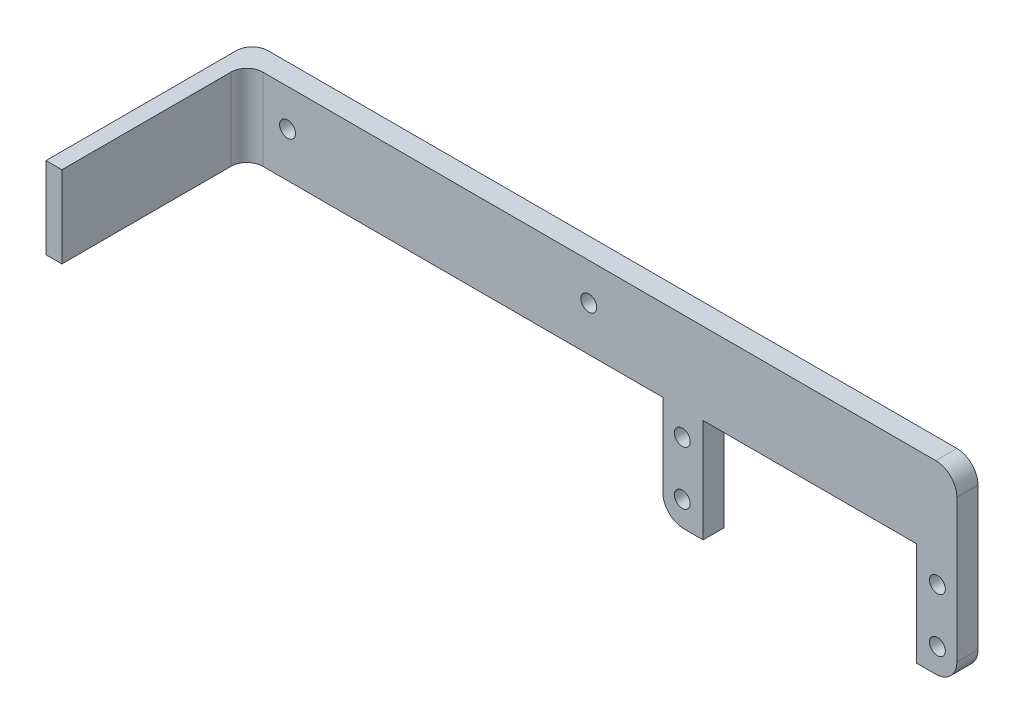
ISO-10303-21;
HEADER;
FILE_DESCRIPTION(('STEP AP214'),'2;1');
FILE_NAME('part.step','',(''),(''),'','','');
FILE_SCHEMA(('AUTOMOTIVE_DESIGN { 1 0 10303 214 1 1 1 1 }'));
ENDSEC;
DATA;
#1=APPLICATION_CONTEXT('core data for automotive mechanical design processes');
#2=APPLICATION_PROTOCOL_DEFINITION('international standard','automotive_design',2000,#1);
#3=PRODUCT_CONTEXT('',#1,'mechanical');
#4=PRODUCT('Part','Part','',(#3));
#5=PRODUCT_RELATED_PRODUCT_CATEGORY('part','',(#4));
#6=PRODUCT_DEFINITION_FORMATION('','',#4);
#7=PRODUCT_DEFINITION_CONTEXT('part definition',#1,'design');
#8=PRODUCT_DEFINITION('design','',#6,#7);
#9=PRODUCT_DEFINITION_SHAPE('','',#8);
#10=(LENGTH_UNIT() NAMED_UNIT(*) SI_UNIT(.MILLI.,.METRE.));
#11=(NAMED_UNIT(*) PLANE_ANGLE_UNIT() SI_UNIT($,.RADIAN.));
#12=(NAMED_UNIT(*) SI_UNIT($,.STERADIAN.) SOLID_ANGLE_UNIT());
#13=UNCERTAINTY_MEASURE_WITH_UNIT(LENGTH_MEASURE(1.E-05),#10,'distance_accuracy_value','');
#14=(GEOMETRIC_REPRESENTATION_CONTEXT(3) GLOBAL_UNCERTAINTY_ASSIGNED_CONTEXT((#13)) GLOBAL_UNIT_ASSIGNED_CONTEXT((#10,
#11,#12)) REPRESENTATION_CONTEXT('',''));
#15=CARTESIAN_POINT('',(0.,0.,0.));
#16=DIRECTION('',(0.,0.,1.));
#17=DIRECTION('',(1.,0.,0.));
#18=AXIS2_PLACEMENT_3D('',#15,#16,#17);
#19=CARTESIAN_POINT('',(0.,32.3655253772291,4.));
#20=DIRECTION('',(0.,1.,0.));
#21=DIRECTION('',(0.,0.,1.));
#22=AXIS2_PLACEMENT_3D('',#19,#20,#21);
#23=PLANE('',#22);
#24=DIRECTION('',(1.,0.,0.));
#25=VECTOR('',#24,1.);
#26=CARTESIAN_POINT('',(0.,32.3655253772291,0.));
#27=LINE('',#26,#25);
#28=CARTESIAN_POINT('',(-153.391060609872,32.3655253772291,0.));
#29=VERTEX_POINT('',#28);
#30=CARTESIAN_POINT('',(-23.0750939681456,32.3655253772291,0.));
#31=VERTEX_POINT('',#30);
#32=EDGE_CURVE('E218',#29,#31,#27,.T.);
#33=ORIENTED_EDGE('',*,*,#32,.F.);
#34=CARTESIAN_POINT('',(-153.391060609872,32.3655253772291,3.));
#35=DIRECTION('',(0.,1.,0.));
#36=DIRECTION('',(0.,0.,1.));
#37=AXIS2_PLACEMENT_3D('',#34,#35,#36);
#38=CIRCLE('',#37,3.);
#39=CARTESIAN_POINT('',(-156.391060609872,32.3655253772291,3.));
#40=VERTEX_POINT('',#39);
#41=EDGE_CURVE('E11',#29,#40,#38,.T.);
#42=ORIENTED_EDGE('',*,*,#41,.T.);
#43=DIRECTION('',(0.,0.,-1.));
#44=VECTOR('',#43,1.);
#45=CARTESIAN_POINT('',(-156.391060609872,32.3655253772291,4.));
#46=LINE('',#45,#44);
#47=CARTESIAN_POINT('',(-156.391060609872,32.3655253772291,39.));
#48=VERTEX_POINT('',#47);
#49=EDGE_CURVE('E160',#48,#40,#46,.T.);
#50=ORIENTED_EDGE('',*,*,#49,.F.);
#51=DIRECTION('',(-1.,0.,0.));
#52=VECTOR('',#51,1.);
#53=CARTESIAN_POINT('',(-156.391060609872,32.3655253772291,39.));
#54=LINE('',#53,#52);
#55=CARTESIAN_POINT('',(-153.384544729697,32.3655253772291,39.));
#56=VERTEX_POINT('',#55);
#57=EDGE_CURVE('E175',#56,#48,#54,.T.);
#58=ORIENTED_EDGE('',*,*,#57,.F.);
#59=DIRECTION('',(0.,0.,-1.));
#60=VECTOR('',#59,1.);
#61=CARTESIAN_POINT('',(-153.384544729697,32.3655253772291,39.));
#62=LINE('',#61,#60);
#63=CARTESIAN_POINT('',(-153.384544729697,32.3655253772291,7.));
#64=VERTEX_POINT('',#63);
#65=EDGE_CURVE('E180',#56,#64,#62,.T.);
#66=ORIENTED_EDGE('',*,*,#65,.T.);
#67=CARTESIAN_POINT('',(-150.384544729697,32.3655253772291,7.));
#68=DIRECTION('',(0.,1.,0.));
#69=DIRECTION('',(0.,0.,1.));
#70=AXIS2_PLACEMENT_3D('',#67,#68,#69);
#71=CIRCLE('',#70,3.);
#72=CARTESIAN_POINT('',(-150.384544729697,32.3655253772291,4.));
#73=VERTEX_POINT('',#72);
#74=EDGE_CURVE('E310',#64,#73,#71,.F.);
#75=ORIENTED_EDGE('',*,*,#74,.T.);
#76=DIRECTION('',(1.,0.,0.));
#77=VECTOR('',#76,1.);
#78=CARTESIAN_POINT('',(0.,32.3655253772291,4.));
#79=LINE('',#78,#77);
#80=CARTESIAN_POINT('',(-23.0750939681456,32.3655253772291,4.));
#81=VERTEX_POINT('',#80);
#82=EDGE_CURVE('E221',#73,#81,#79,.T.);
#83=ORIENTED_EDGE('',*,*,#82,.T.);
#84=DIRECTION('',(0.,0.,-1.));
#85=VECTOR('',#84,1.);
#86=CARTESIAN_POINT('',(-23.0750939681456,32.3655253772291,0.));
#87=LINE('',#86,#85);
#88=EDGE_CURVE('E277',#81,#31,#87,.T.);
#89=ORIENTED_EDGE('',*,*,#88,.T.);
#90=EDGE_LOOP('',(#33,#42,#50,#58,#66,#75,#83,#89));
#91=FACE_BOUND('',#90,.T.);
#92=ADVANCED_FACE('F35',(#91),#23,.T.);
#93=CARTESIAN_POINT('',(-156.391060609872,0.,4.));
#94=DIRECTION('',(1.,0.,0.));
#95=DIRECTION('',(0.,0.,-1.));
#96=AXIS2_PLACEMENT_3D('',#93,#94,#95);
#97=PLANE('',#96);
#98=ORIENTED_EDGE('',*,*,#49,.T.);
#99=DIRECTION('',(0.,-1.,0.));
#100=VECTOR('',#99,1.);
#101=CARTESIAN_POINT('',(-156.391060609872,0.,3.));
#102=LINE('',#101,#100);
#103=CARTESIAN_POINT('',(-156.391060609872,16.9235253772291,3.));
#104=VERTEX_POINT('',#103);
#105=EDGE_CURVE('E159',#40,#104,#102,.T.);
#106=ORIENTED_EDGE('',*,*,#105,.T.);
#107=DIRECTION('',(0.,0.,-1.));
#108=VECTOR('',#107,1.);
#109=CARTESIAN_POINT('',(-156.391060609872,16.9235253772291,4.));
#110=LINE('',#109,#108);
#111=CARTESIAN_POINT('',(-156.391060609872,16.9235253772291,39.));
#112=VERTEX_POINT('',#111);
#113=EDGE_CURVE('E152',#112,#104,#110,.T.);
#114=ORIENTED_EDGE('',*,*,#113,.F.);
#115=DIRECTION('',(0.,-1.,0.));
#116=VECTOR('',#115,1.);
#117=CARTESIAN_POINT('',(-156.391060609872,32.3655253772291,39.));
#118=LINE('',#117,#116);
#119=EDGE_CURVE('E157',#48,#112,#118,.T.);
#120=ORIENTED_EDGE('',*,*,#119,.F.);
#121=EDGE_LOOP('',(#98,#106,#114,#120));
#122=FACE_BOUND('',#121,.T.);
#123=ADVANCED_FACE('F155',(#122),#97,.F.);
#124=CARTESIAN_POINT('',(0.,16.9235253772291,4.));
#125=DIRECTION('',(0.,1.,0.));
#126=DIRECTION('',(0.,0.,1.));
#127=AXIS2_PLACEMENT_3D('',#124,#125,#126);
#128=PLANE('',#127);
#129=ORIENTED_EDGE('',*,*,#113,.T.);
#130=CARTESIAN_POINT('',(-153.391060609872,16.9235253772291,3.));
#131=DIRECTION('',(0.,1.,0.));
#132=DIRECTION('',(0.,0.,1.));
#133=AXIS2_PLACEMENT_3D('',#130,#131,#132);
#134=CIRCLE('',#133,3.);
#135=CARTESIAN_POINT('',(-153.391060609872,16.9235253772291,0.));
#136=VERTEX_POINT('',#135);
#137=EDGE_CURVE('E57',#104,#136,#134,.F.);
#138=ORIENTED_EDGE('',*,*,#137,.T.);
#139=DIRECTION('',(1.,0.,0.));
#140=VECTOR('',#139,1.);
#141=CARTESIAN_POINT('',(0.,16.9235253772291,0.));
#142=LINE('',#141,#140);
#143=CARTESIAN_POINT('',(-74.7010939681456,16.9235253772291,0.));
#144=VERTEX_POINT('',#143);
#145=EDGE_CURVE('E245',#136,#144,#142,.T.);
#146=ORIENTED_EDGE('',*,*,#145,.T.);
#147=DIRECTION('',(0.,0.,-1.));
#148=VECTOR('',#147,1.);
#149=CARTESIAN_POINT('',(-74.7010939681456,16.9235253772291,4.));
#150=LINE('',#149,#148);
#151=CARTESIAN_POINT('',(-74.7010939681456,16.9235253772291,4.));
#152=VERTEX_POINT('',#151);
#153=EDGE_CURVE('E161',#152,#144,#150,.T.);
#154=ORIENTED_EDGE('',*,*,#153,.F.);
#155=DIRECTION('',(1.,0.,0.));
#156=VECTOR('',#155,1.);
#157=CARTESIAN_POINT('',(0.,16.9235253772291,4.));
#158=LINE('',#157,#156);
#159=CARTESIAN_POINT('',(-150.384544729697,16.9235253772291,4.));
#160=VERTEX_POINT('',#159);
#161=EDGE_CURVE('E223',#160,#152,#158,.T.);
#162=ORIENTED_EDGE('',*,*,#161,.F.);
#163=CARTESIAN_POINT('',(-150.384544729697,16.9235253772291,7.));
#164=DIRECTION('',(0.,1.,0.));
#165=DIRECTION('',(0.,0.,1.));
#166=AXIS2_PLACEMENT_3D('',#163,#164,#165);
#167=CIRCLE('',#166,3.);
#168=CARTESIAN_POINT('',(-153.384544729697,16.9235253772291,7.));
#169=VERTEX_POINT('',#168);
#170=EDGE_CURVE('E312',#160,#169,#167,.T.);
#171=ORIENTED_EDGE('',*,*,#170,.T.);
#172=DIRECTION('',(0.,0.,-1.));
#173=VECTOR('',#172,1.);
#174=CARTESIAN_POINT('',(-153.384544729697,16.9235253772291,39.));
#175=LINE('',#174,#173);
#176=CARTESIAN_POINT('',(-153.384544729697,16.9235253772291,39.));
#177=VERTEX_POINT('',#176);
#178=EDGE_CURVE('E167',#177,#169,#175,.T.);
#179=ORIENTED_EDGE('',*,*,#178,.F.);
#180=DIRECTION('',(1.,0.,0.));
#181=VECTOR('',#180,1.);
#182=CARTESIAN_POINT('',(-156.391060609872,16.9235253772291,39.));
#183=LINE('',#182,#181);
#184=EDGE_CURVE('E164',#112,#177,#183,.T.);
#185=ORIENTED_EDGE('',*,*,#184,.F.);
#186=EDGE_LOOP('',(#129,#138,#146,#154,#162,#171,#179,#185));
#187=FACE_BOUND('',#186,.T.);
#188=ADVANCED_FACE('F165',(#187),#128,.F.);
#189=CARTESIAN_POINT('',(-74.7010939681456,0.,4.));
#190=DIRECTION('',(1.,0.,0.));
#191=DIRECTION('',(0.,0.,-1.));
#192=AXIS2_PLACEMENT_3D('',#189,#190,#191);
#193=PLANE('',#192);
#194=DIRECTION('',(0.,-1.,0.));
#195=VECTOR('',#194,1.);
#196=CARTESIAN_POINT('',(-74.7010939681456,0.,0.));
#197=LINE('',#196,#195);
#198=CARTESIAN_POINT('',(-74.7010939681456,1.36552537722908,0.));
#199=VERTEX_POINT('',#198);
#200=EDGE_CURVE('E247',#144,#199,#197,.T.);
#201=ORIENTED_EDGE('',*,*,#200,.T.);
#202=DIRECTION('',(0.,0.,-1.));
#203=VECTOR('',#202,1.);
#204=CARTESIAN_POINT('',(-74.7010939681456,1.36552537722908,4.));
#205=LINE('',#204,#203);
#206=CARTESIAN_POINT('',(-74.7010939681456,1.36552537722908,4.));
#207=VERTEX_POINT('',#206);
#208=EDGE_CURVE('E301',#199,#207,#205,.F.);
#209=ORIENTED_EDGE('',*,*,#208,.T.);
#210=DIRECTION('',(0.,-1.,0.));
#211=VECTOR('',#210,1.);
#212=CARTESIAN_POINT('',(-74.7010939681456,0.,4.));
#213=LINE('',#212,#211);
#214=EDGE_CURVE('E226',#152,#207,#213,.T.);
#215=ORIENTED_EDGE('',*,*,#214,.F.);
#216=ORIENTED_EDGE('',*,*,#153,.T.);
#217=EDGE_LOOP('',(#201,#209,#215,#216));
#218=FACE_BOUND('',#217,.T.);
#219=ADVANCED_FACE('F402',(#218),#193,.F.);
#220=CARTESIAN_POINT('',(0.,-2.63447462277092,4.));
#221=DIRECTION('',(0.,1.,0.));
#222=DIRECTION('',(0.,0.,1.));
#223=AXIS2_PLACEMENT_3D('',#220,#221,#222);
#224=PLANE('',#223);
#225=DIRECTION('',(1.,0.,0.));
#226=VECTOR('',#225,1.);
#227=CARTESIAN_POINT('',(0.,-2.63447462277092,4.));
#228=LINE('',#227,#226);
#229=CARTESIAN_POINT('',(-70.7010939681456,-2.63447462277092,4.));
#230=VERTEX_POINT('',#229);
#231=CARTESIAN_POINT('',(-67.0810939681456,-2.63447462277092,4.));
#232=VERTEX_POINT('',#231);
#233=EDGE_CURVE('E229',#230,#232,#228,.T.);
#234=ORIENTED_EDGE('',*,*,#233,.F.);
#235=DIRECTION('',(0.,0.,-1.));
#236=VECTOR('',#235,1.);
#237=CARTESIAN_POINT('',(-70.7010939681456,-2.63447462277092,4.));
#238=LINE('',#237,#236);
#239=CARTESIAN_POINT('',(-70.7010939681456,-2.63447462277092,0.));
#240=VERTEX_POINT('',#239);
#241=EDGE_CURVE('E298',#230,#240,#238,.T.);
#242=ORIENTED_EDGE('',*,*,#241,.T.);
#243=DIRECTION('',(1.,0.,0.));
#244=VECTOR('',#243,1.);
#245=CARTESIAN_POINT('',(0.,-2.63447462277092,0.));
#246=LINE('',#245,#244);
#247=CARTESIAN_POINT('',(-67.0810939681456,-2.63447462277092,0.));
#248=VERTEX_POINT('',#247);
#249=EDGE_CURVE('E250',#240,#248,#246,.T.);
#250=ORIENTED_EDGE('',*,*,#249,.T.);
#251=DIRECTION('',(0.,0.,-1.));
#252=VECTOR('',#251,1.);
#253=CARTESIAN_POINT('',(-67.0810939681456,-2.63447462277092,4.));
#254=LINE('',#253,#252);
#255=EDGE_CURVE('E271',#232,#248,#254,.T.);
#256=ORIENTED_EDGE('',*,*,#255,.F.);
#257=EDGE_LOOP('',(#234,#242,#250,#256));
#258=FACE_BOUND('',#257,.T.);
#259=ADVANCED_FACE('F397',(#258),#224,.F.);
#260=CARTESIAN_POINT('',(-67.0810939681456,0.,4.));
#261=DIRECTION('',(-1.,0.,0.));
#262=DIRECTION('',(0.,0.,1.));
#263=AXIS2_PLACEMENT_3D('',#260,#261,#262);
#264=PLANE('',#263);
#265=DIRECTION('',(0.,1.,0.));
#266=VECTOR('',#265,1.);
#267=CARTESIAN_POINT('',(-67.0810939681456,0.,0.));
#268=LINE('',#267,#266);
#269=CARTESIAN_POINT('',(-67.0810939681456,16.9235253772291,0.));
#270=VERTEX_POINT('',#269);
#271=EDGE_CURVE('E252',#248,#270,#268,.T.);
#272=ORIENTED_EDGE('',*,*,#271,.T.);
#273=DIRECTION('',(0.,0.,-1.));
#274=VECTOR('',#273,1.);
#275=CARTESIAN_POINT('',(-67.0810939681456,16.9235253772291,4.));
#276=LINE('',#275,#274);
#277=CARTESIAN_POINT('',(-67.0810939681456,16.9235253772291,4.));
#278=VERTEX_POINT('',#277);
#279=EDGE_CURVE('E268',#278,#270,#276,.T.);
#280=ORIENTED_EDGE('',*,*,#279,.F.);
#281=DIRECTION('',(0.,1.,0.));
#282=VECTOR('',#281,1.);
#283=CARTESIAN_POINT('',(-67.0810939681456,0.,4.));
#284=LINE('',#283,#282);
#285=EDGE_CURVE('E231',#232,#278,#284,.T.);
#286=ORIENTED_EDGE('',*,*,#285,.F.);
#287=ORIENTED_EDGE('',*,*,#255,.T.);
#288=EDGE_LOOP('',(#272,#280,#286,#287));
#289=FACE_BOUND('',#288,.T.);
#290=ADVANCED_FACE('F393',(#289),#264,.F.);
#291=CARTESIAN_POINT('',(0.,16.9235253772291,4.));
#292=DIRECTION('',(0.,1.,0.));
#293=DIRECTION('',(0.,0.,1.));
#294=AXIS2_PLACEMENT_3D('',#291,#292,#293);
#295=PLANE('',#294);
#296=DIRECTION('',(1.,0.,0.));
#297=VECTOR('',#296,1.);
#298=CARTESIAN_POINT('',(0.,16.9235253772291,0.));
#299=LINE('',#298,#297);
#300=CARTESIAN_POINT('',(-26.6950939681456,16.9235253772291,0.));
#301=VERTEX_POINT('',#300);
#302=EDGE_CURVE('E254',#270,#301,#299,.T.);
#303=ORIENTED_EDGE('',*,*,#302,.T.);
#304=DIRECTION('',(0.,0.,-1.));
#305=VECTOR('',#304,1.);
#306=CARTESIAN_POINT('',(-26.6950939681456,16.9235253772291,4.));
#307=LINE('',#306,#305);
#308=CARTESIAN_POINT('',(-26.6950939681456,16.9235253772291,4.));
#309=VERTEX_POINT('',#308);
#310=EDGE_CURVE('E265',#309,#301,#307,.T.);
#311=ORIENTED_EDGE('',*,*,#310,.F.);
#312=DIRECTION('',(1.,0.,0.));
#313=VECTOR('',#312,1.);
#314=CARTESIAN_POINT('',(0.,16.9235253772291,4.));
#315=LINE('',#314,#313);
#316=EDGE_CURVE('E233',#278,#309,#315,.T.);
#317=ORIENTED_EDGE('',*,*,#316,.F.);
#318=ORIENTED_EDGE('',*,*,#279,.T.);
#319=EDGE_LOOP('',(#303,#311,#317,#318));
#320=FACE_BOUND('',#319,.T.);
#321=ADVANCED_FACE('F388',(#320),#295,.F.);
#322=CARTESIAN_POINT('',(-26.6950939681456,0.,4.));
#323=DIRECTION('',(1.,0.,0.));
#324=DIRECTION('',(0.,0.,-1.));
#325=AXIS2_PLACEMENT_3D('',#322,#323,#324);
#326=PLANE('',#325);
#327=DIRECTION('',(0.,-1.,0.));
#328=VECTOR('',#327,1.);
#329=CARTESIAN_POINT('',(-26.6950939681456,0.,0.));
#330=LINE('',#329,#328);
#331=CARTESIAN_POINT('',(-26.6950939681456,-2.63447462277092,0.));
#332=VERTEX_POINT('',#331);
#333=EDGE_CURVE('E256',#301,#332,#330,.T.);
#334=ORIENTED_EDGE('',*,*,#333,.T.);
#335=DIRECTION('',(0.,0.,-1.));
#336=VECTOR('',#335,1.);
#337=CARTESIAN_POINT('',(-26.6950939681456,-2.63447462277092,4.));
#338=LINE('',#337,#336);
#339=CARTESIAN_POINT('',(-26.6950939681456,-2.63447462277092,4.));
#340=VERTEX_POINT('',#339);
#341=EDGE_CURVE('E243',#340,#332,#338,.T.);
#342=ORIENTED_EDGE('',*,*,#341,.F.);
#343=DIRECTION('',(0.,-1.,0.));
#344=VECTOR('',#343,1.);
#345=CARTESIAN_POINT('',(-26.6950939681456,0.,4.));
#346=LINE('',#345,#344);
#347=EDGE_CURVE('E235',#309,#340,#346,.T.);
#348=ORIENTED_EDGE('',*,*,#347,.F.);
#349=ORIENTED_EDGE('',*,*,#310,.T.);
#350=EDGE_LOOP('',(#334,#342,#348,#349));
#351=FACE_BOUND('',#350,.T.);
#352=ADVANCED_FACE('F382',(#351),#326,.F.);
#353=CARTESIAN_POINT('',(0.,-2.63447462277092,4.));
#354=DIRECTION('',(0.,1.,0.));
#355=DIRECTION('',(0.,0.,1.));
#356=AXIS2_PLACEMENT_3D('',#353,#354,#355);
#357=PLANE('',#356);
#358=DIRECTION('',(1.,0.,0.));
#359=VECTOR('',#358,1.);
#360=CARTESIAN_POINT('',(0.,-2.63447462277092,0.));
#361=LINE('',#360,#359);
#362=CARTESIAN_POINT('',(-23.0750939681456,-2.63447462277092,0.));
#363=VERTEX_POINT('',#362);
#364=EDGE_CURVE('E258',#332,#363,#361,.T.);
#365=ORIENTED_EDGE('',*,*,#364,.T.);
#366=DIRECTION('',(0.,0.,-1.));
#367=VECTOR('',#366,1.);
#368=CARTESIAN_POINT('',(-23.0750939681456,-2.63447462277092,4.));
#369=LINE('',#368,#367);
#370=CARTESIAN_POINT('',(-23.0750939681456,-2.63447462277092,4.));
#371=VERTEX_POINT('',#370);
#372=EDGE_CURVE('E303',#363,#371,#369,.F.);
#373=ORIENTED_EDGE('',*,*,#372,.T.);
#374=DIRECTION('',(1.,0.,0.));
#375=VECTOR('',#374,1.);
#376=CARTESIAN_POINT('',(0.,-2.63447462277092,4.));
#377=LINE('',#376,#375);
#378=EDGE_CURVE('E237',#340,#371,#377,.T.);
#379=ORIENTED_EDGE('',*,*,#378,.F.);
#380=ORIENTED_EDGE('',*,*,#341,.T.);
#381=EDGE_LOOP('',(#365,#373,#379,#380));
#382=FACE_BOUND('',#381,.T.);
#383=ADVANCED_FACE('F378',(#382),#357,.F.);
#384=CARTESIAN_POINT('',(-19.0750939681456,0.,4.));
#385=DIRECTION('',(-1.,0.,0.));
#386=DIRECTION('',(0.,0.,1.));
#387=AXIS2_PLACEMENT_3D('',#384,#385,#386);
#388=PLANE('',#387);
#389=DIRECTION('',(0.,1.,0.));
#390=VECTOR('',#389,1.);
#391=CARTESIAN_POINT('',(-19.0750939681456,0.,0.));
#392=LINE('',#391,#390);
#393=CARTESIAN_POINT('',(-19.0750939681456,1.36552537722908,0.));
#394=VERTEX_POINT('',#393);
#395=CARTESIAN_POINT('',(-19.0750939681456,28.3655253772291,0.));
#396=VERTEX_POINT('',#395);
#397=EDGE_CURVE('E224',#394,#396,#392,.T.);
#398=ORIENTED_EDGE('',*,*,#397,.T.);
#399=DIRECTION('',(0.,0.,-1.));
#400=VECTOR('',#399,1.);
#401=CARTESIAN_POINT('',(-19.0750939681456,28.3655253772291,4.));
#402=LINE('',#401,#400);
#403=CARTESIAN_POINT('',(-19.0750939681456,28.3655253772291,4.));
#404=VERTEX_POINT('',#403);
#405=EDGE_CURVE('E289',#396,#404,#402,.F.);
#406=ORIENTED_EDGE('',*,*,#405,.T.);
#407=DIRECTION('',(0.,1.,0.));
#408=VECTOR('',#407,1.);
#409=CARTESIAN_POINT('',(-19.0750939681456,0.,4.));
#410=LINE('',#409,#408);
#411=CARTESIAN_POINT('',(-19.0750939681456,1.36552537722908,4.));
#412=VERTEX_POINT('',#411);
#413=EDGE_CURVE('E240',#412,#404,#410,.T.);
#414=ORIENTED_EDGE('',*,*,#413,.F.);
#415=DIRECTION('',(0.,0.,-1.));
#416=VECTOR('',#415,1.);
#417=CARTESIAN_POINT('',(-19.0750939681456,1.36552537722908,4.));
#418=LINE('',#417,#416);
#419=EDGE_CURVE('E286',#412,#394,#418,.T.);
#420=ORIENTED_EDGE('',*,*,#419,.T.);
#421=EDGE_LOOP('',(#398,#406,#414,#420));
#422=FACE_BOUND('',#421,.T.);
#423=ADVANCED_FACE('F373',(#422),#388,.F.);
#424=CARTESIAN_POINT('',(0.,0.,4.));
#425=DIRECTION('',(0.,0.,1.));
#426=DIRECTION('',(1.,0.,0.));
#427=AXIS2_PLACEMENT_3D('',#424,#425,#426);
#428=PLANE('',#427);
#429=ORIENTED_EDGE('',*,*,#82,.F.);
#430=DIRECTION('',(0.,1.,0.));
#431=VECTOR('',#430,1.);
#432=CARTESIAN_POINT('',(-150.384544729697,0.,4.));
#433=LINE('',#432,#431);
#434=EDGE_CURVE('E308',#73,#160,#433,.F.);
#435=ORIENTED_EDGE('',*,*,#434,.T.);
#436=ORIENTED_EDGE('',*,*,#161,.T.);
#437=ORIENTED_EDGE('',*,*,#214,.T.);
#438=CARTESIAN_POINT('',(-70.7010939681456,1.36552537722908,4.));
#439=DIRECTION('',(0.,0.,1.));
#440=DIRECTION('',(1.,0.,0.));
#441=AXIS2_PLACEMENT_3D('',#438,#439,#440);
#442=CIRCLE('',#441,4.);
#443=EDGE_CURVE('E293',#207,#230,#442,.T.);
#444=ORIENTED_EDGE('',*,*,#443,.T.);
#445=ORIENTED_EDGE('',*,*,#233,.T.);
#446=ORIENTED_EDGE('',*,*,#285,.T.);
#447=ORIENTED_EDGE('',*,*,#316,.T.);
#448=ORIENTED_EDGE('',*,*,#347,.T.);
#449=ORIENTED_EDGE('',*,*,#378,.T.);
#450=CARTESIAN_POINT('',(-23.0750939681456,1.36552537722908,4.));
#451=DIRECTION('',(0.,0.,1.));
#452=DIRECTION('',(1.,0.,0.));
#453=AXIS2_PLACEMENT_3D('',#450,#451,#452);
#454=CIRCLE('',#453,4.);
#455=EDGE_CURVE('E291',#371,#412,#454,.T.);
#456=ORIENTED_EDGE('',*,*,#455,.T.);
#457=ORIENTED_EDGE('',*,*,#413,.T.);
#458=CARTESIAN_POINT('',(-23.0750939681456,28.3655253772291,4.));
#459=DIRECTION('',(0.,0.,1.));
#460=DIRECTION('',(1.,0.,0.));
#461=AXIS2_PLACEMENT_3D('',#458,#459,#460);
#462=CIRCLE('',#461,4.);
#463=EDGE_CURVE('E295',#404,#81,#462,.T.);
#464=ORIENTED_EDGE('',*,*,#463,.T.);
#465=EDGE_LOOP('',(#429,#435,#436,#437,#444,#445,#446,#447,#448,#449,#456,#457,#464));
#466=FACE_BOUND('',#465,.T.);
#467=CARTESIAN_POINT('',(-88.7010939681456,25.3655253772291,4.));
#468=DIRECTION('',(0.,0.,1.));
#469=DIRECTION('',(1.,0.,0.));
#470=AXIS2_PLACEMENT_3D('',#467,#468,#469);
#471=CIRCLE('',#470,1.5);
#472=CARTESIAN_POINT('',(-87.2010939681456,25.3655253772291,4.));
#473=VERTEX_POINT('',#472);
#474=EDGE_CURVE('E185',#473,#473,#471,.T.);
#475=ORIENTED_EDGE('',*,*,#474,.F.);
#476=EDGE_LOOP('',(#475));
#477=FACE_BOUND('',#476,.T.);
#478=CARTESIAN_POINT('',(-145.701093968146,25.3655253772291,4.));
#479=DIRECTION('',(0.,0.,1.));
#480=DIRECTION('',(1.,0.,0.));
#481=AXIS2_PLACEMENT_3D('',#478,#479,#480);
#482=CIRCLE('',#481,1.5);
#483=CARTESIAN_POINT('',(-144.201093968146,25.3655253772291,4.));
#484=VERTEX_POINT('',#483);
#485=EDGE_CURVE('E188',#484,#484,#482,.T.);
#486=ORIENTED_EDGE('',*,*,#485,.F.);
#487=EDGE_LOOP('',(#486));
#488=FACE_BOUND('',#487,.T.);
#489=CARTESIAN_POINT('',(-71.0180939681455,2.06452537722908,4.));
#490=DIRECTION('',(0.,0.,1.));
#491=DIRECTION('',(1.,0.,0.));
#492=AXIS2_PLACEMENT_3D('',#489,#490,#491);
#493=CIRCLE('',#492,1.5);
#494=CARTESIAN_POINT('',(-69.5180939681455,2.06452537722908,4.));
#495=VERTEX_POINT('',#494);
#496=EDGE_CURVE('E194',#495,#495,#493,.T.);
#497=ORIENTED_EDGE('',*,*,#496,.F.);
#498=EDGE_LOOP('',(#497));
#499=FACE_BOUND('',#498,.T.);
#500=CARTESIAN_POINT('',(-22.7580939681455,2.06452537722908,4.));
#501=DIRECTION('',(0.,0.,1.));
#502=DIRECTION('',(1.,0.,0.));
#503=AXIS2_PLACEMENT_3D('',#500,#501,#502);
#504=CIRCLE('',#503,1.5);
#505=CARTESIAN_POINT('',(-21.2580939681455,2.06452537722908,4.));
#506=VERTEX_POINT('',#505);
#507=EDGE_CURVE('E200',#506,#506,#504,.T.);
#508=ORIENTED_EDGE('',*,*,#507,.F.);
#509=EDGE_LOOP('',(#508));
#510=FACE_BOUND('',#509,.T.);
#511=CARTESIAN_POINT('',(-22.7580939681456,12.2245253772291,4.));
#512=DIRECTION('',(0.,0.,1.));
#513=DIRECTION('',(1.,0.,0.));
#514=AXIS2_PLACEMENT_3D('',#511,#512,#513);
#515=CIRCLE('',#514,1.5);
#516=CARTESIAN_POINT('',(-21.2580939681456,12.2245253772291,4.));
#517=VERTEX_POINT('',#516);
#518=EDGE_CURVE('E206',#517,#517,#515,.T.);
#519=ORIENTED_EDGE('',*,*,#518,.F.);
#520=EDGE_LOOP('',(#519));
#521=FACE_BOUND('',#520,.T.);
#522=CARTESIAN_POINT('',(-71.0180939681456,12.2245253772291,4.));
#523=DIRECTION('',(0.,0.,1.));
#524=DIRECTION('',(1.,0.,0.));
#525=AXIS2_PLACEMENT_3D('',#522,#523,#524);
#526=CIRCLE('',#525,1.5);
#527=CARTESIAN_POINT('',(-69.5180939681456,12.2245253772291,4.));
#528=VERTEX_POINT('',#527);
#529=EDGE_CURVE('E212',#528,#528,#526,.T.);
#530=ORIENTED_EDGE('',*,*,#529,.F.);
#531=EDGE_LOOP('',(#530));
#532=FACE_BOUND('',#531,.T.);
#533=ADVANCED_FACE('F328',(#466,#477,#488,#499,#510,#521,#532),#428,.T.);
#534=CARTESIAN_POINT('',(0.,0.,0.));
#535=DIRECTION('',(0.,0.,1.));
#536=DIRECTION('',(1.,0.,0.));
#537=AXIS2_PLACEMENT_3D('',#534,#535,#536);
#538=PLANE('',#537);
#539=CARTESIAN_POINT('',(-88.7010939681456,25.3655253772291,0.));
#540=DIRECTION('',(0.,0.,1.));
#541=DIRECTION('',(1.,0.,0.));
#542=AXIS2_PLACEMENT_3D('',#539,#540,#541);
#543=CIRCLE('',#542,1.5);
#544=CARTESIAN_POINT('',(-87.2010939681456,25.3655253772291,0.));
#545=VERTEX_POINT('',#544);
#546=EDGE_CURVE('E184',#545,#545,#543,.T.);
#547=ORIENTED_EDGE('',*,*,#546,.T.);
#548=EDGE_LOOP('',(#547));
#549=FACE_BOUND('',#548,.T.);
#550=CARTESIAN_POINT('',(-145.701093968146,25.3655253772291,0.));
#551=DIRECTION('',(0.,0.,1.));
#552=DIRECTION('',(1.,0.,0.));
#553=AXIS2_PLACEMENT_3D('',#550,#551,#552);
#554=CIRCLE('',#553,1.5);
#555=CARTESIAN_POINT('',(-144.201093968146,25.3655253772291,0.));
#556=VERTEX_POINT('',#555);
#557=EDGE_CURVE('E191',#556,#556,#554,.T.);
#558=ORIENTED_EDGE('',*,*,#557,.T.);
#559=EDGE_LOOP('',(#558));
#560=FACE_BOUND('',#559,.T.);
#561=CARTESIAN_POINT('',(-71.0180939681455,2.06452537722908,0.));
#562=DIRECTION('',(0.,0.,1.));
#563=DIRECTION('',(1.,0.,0.));
#564=AXIS2_PLACEMENT_3D('',#561,#562,#563);
#565=CIRCLE('',#564,1.5);
#566=CARTESIAN_POINT('',(-69.5180939681455,2.06452537722908,0.));
#567=VERTEX_POINT('',#566);
#568=EDGE_CURVE('E197',#567,#567,#565,.T.);
#569=ORIENTED_EDGE('',*,*,#568,.T.);
#570=EDGE_LOOP('',(#569));
#571=FACE_BOUND('',#570,.T.);
#572=CARTESIAN_POINT('',(-22.7580939681455,2.06452537722908,0.));
#573=DIRECTION('',(0.,0.,1.));
#574=DIRECTION('',(1.,0.,0.));
#575=AXIS2_PLACEMENT_3D('',#572,#573,#574);
#576=CIRCLE('',#575,1.5);
#577=CARTESIAN_POINT('',(-21.2580939681455,2.06452537722908,0.));
#578=VERTEX_POINT('',#577);
#579=EDGE_CURVE('E203',#578,#578,#576,.T.);
#580=ORIENTED_EDGE('',*,*,#579,.T.);
#581=EDGE_LOOP('',(#580));
#582=FACE_BOUND('',#581,.T.);
#583=CARTESIAN_POINT('',(-22.7580939681456,12.2245253772291,0.));
#584=DIRECTION('',(0.,0.,1.));
#585=DIRECTION('',(1.,0.,0.));
#586=AXIS2_PLACEMENT_3D('',#583,#584,#585);
#587=CIRCLE('',#586,1.5);
#588=CARTESIAN_POINT('',(-21.2580939681456,12.2245253772291,0.));
#589=VERTEX_POINT('',#588);
#590=EDGE_CURVE('E209',#589,#589,#587,.T.);
#591=ORIENTED_EDGE('',*,*,#590,.T.);
#592=EDGE_LOOP('',(#591));
#593=FACE_BOUND('',#592,.T.);
#594=CARTESIAN_POINT('',(-71.0180939681456,12.2245253772291,0.));
#595=DIRECTION('',(0.,0.,1.));
#596=DIRECTION('',(1.,0.,0.));
#597=AXIS2_PLACEMENT_3D('',#594,#595,#596);
#598=CIRCLE('',#597,1.5);
#599=CARTESIAN_POINT('',(-69.5180939681456,12.2245253772291,0.));
#600=VERTEX_POINT('',#599);
#601=EDGE_CURVE('E215',#600,#600,#598,.T.);
#602=ORIENTED_EDGE('',*,*,#601,.T.);
#603=EDGE_LOOP('',(#602));
#604=FACE_BOUND('',#603,.T.);
#605=ORIENTED_EDGE('',*,*,#145,.F.);
#606=DIRECTION('',(0.,-1.,0.));
#607=VECTOR('',#606,1.);
#608=CARTESIAN_POINT('',(-153.391060609872,0.,0.));
#609=LINE('',#608,#607);
#610=EDGE_CURVE('E43',#136,#29,#609,.F.);
#611=ORIENTED_EDGE('',*,*,#610,.T.);
#612=ORIENTED_EDGE('',*,*,#32,.T.);
#613=CARTESIAN_POINT('',(-23.0750939681456,28.3655253772291,0.));
#614=DIRECTION('',(0.,0.,1.));
#615=DIRECTION('',(1.,0.,0.));
#616=AXIS2_PLACEMENT_3D('',#613,#614,#615);
#617=CIRCLE('',#616,4.);
#618=EDGE_CURVE('E284',#31,#396,#617,.F.);
#619=ORIENTED_EDGE('',*,*,#618,.T.);
#620=ORIENTED_EDGE('',*,*,#397,.F.);
#621=CARTESIAN_POINT('',(-23.0750939681456,1.36552537722908,0.));
#622=DIRECTION('',(0.,0.,1.));
#623=DIRECTION('',(1.,0.,0.));
#624=AXIS2_PLACEMENT_3D('',#621,#622,#623);
#625=CIRCLE('',#624,4.);
#626=EDGE_CURVE('E280',#394,#363,#625,.F.);
#627=ORIENTED_EDGE('',*,*,#626,.T.);
#628=ORIENTED_EDGE('',*,*,#364,.F.);
#629=ORIENTED_EDGE('',*,*,#333,.F.);
#630=ORIENTED_EDGE('',*,*,#302,.F.);
#631=ORIENTED_EDGE('',*,*,#271,.F.);
#632=ORIENTED_EDGE('',*,*,#249,.F.);
#633=CARTESIAN_POINT('',(-70.7010939681456,1.36552537722908,0.));
#634=DIRECTION('',(0.,0.,1.));
#635=DIRECTION('',(1.,0.,0.));
#636=AXIS2_PLACEMENT_3D('',#633,#634,#635);
#637=CIRCLE('',#636,4.);
#638=EDGE_CURVE('E282',#240,#199,#637,.F.);
#639=ORIENTED_EDGE('',*,*,#638,.T.);
#640=ORIENTED_EDGE('',*,*,#200,.F.);
#641=EDGE_LOOP('',(#605,#611,#612,#619,#620,#627,#628,#629,#630,#631,#632,#639,#640));
#642=FACE_BOUND('',#641,.T.);
#643=ADVANCED_FACE('F354',(#549,#560,#571,#582,#593,#604,#642),#538,.F.);
#644=CARTESIAN_POINT('',(-23.0750939681456,28.3655253772291,4.));
#645=DIRECTION('',(0.,0.,1.));
#646=DIRECTION('',(1.,0.,0.));
#647=AXIS2_PLACEMENT_3D('',#644,#645,#646);
#648=CYLINDRICAL_SURFACE('',#647,4.);
#649=ORIENTED_EDGE('',*,*,#463,.F.);
#650=ORIENTED_EDGE('',*,*,#405,.F.);
#651=ORIENTED_EDGE('',*,*,#618,.F.);
#652=ORIENTED_EDGE('',*,*,#88,.F.);
#653=EDGE_LOOP('',(#649,#650,#651,#652));
#654=FACE_BOUND('',#653,.T.);
#655=ADVANCED_FACE('F336',(#654),#648,.T.);
#656=CARTESIAN_POINT('',(-70.7010939681456,1.36552537722908,4.));
#657=DIRECTION('',(0.,0.,-1.));
#658=DIRECTION('',(-1.,0.,0.));
#659=AXIS2_PLACEMENT_3D('',#656,#657,#658);
#660=CYLINDRICAL_SURFACE('',#659,4.);
#661=ORIENTED_EDGE('',*,*,#443,.F.);
#662=ORIENTED_EDGE('',*,*,#208,.F.);
#663=ORIENTED_EDGE('',*,*,#638,.F.);
#664=ORIENTED_EDGE('',*,*,#241,.F.);
#665=EDGE_LOOP('',(#661,#662,#663,#664));
#666=FACE_BOUND('',#665,.T.);
#667=ADVANCED_FACE('F353',(#666),#660,.T.);
#668=CARTESIAN_POINT('',(-23.0750939681456,1.36552537722908,4.));
#669=DIRECTION('',(0.,0.,-1.));
#670=DIRECTION('',(-1.,0.,0.));
#671=AXIS2_PLACEMENT_3D('',#668,#669,#670);
#672=CYLINDRICAL_SURFACE('',#671,4.);
#673=ORIENTED_EDGE('',*,*,#455,.F.);
#674=ORIENTED_EDGE('',*,*,#372,.F.);
#675=ORIENTED_EDGE('',*,*,#626,.F.);
#676=ORIENTED_EDGE('',*,*,#419,.F.);
#677=EDGE_LOOP('',(#673,#674,#675,#676));
#678=FACE_BOUND('',#677,.T.);
#679=ADVANCED_FACE('F357',(#678),#672,.T.);
#680=CARTESIAN_POINT('',(-71.0180939681456,12.2245253772291,0.));
#681=DIRECTION('',(0.,0.,1.));
#682=DIRECTION('',(1.,0.,0.));
#683=AXIS2_PLACEMENT_3D('',#680,#681,#682);
#684=CYLINDRICAL_SURFACE('',#683,1.5);
#685=ORIENTED_EDGE('',*,*,#601,.F.);
#686=EDGE_LOOP('',(#685));
#687=FACE_BOUND('',#686,.T.);
#688=ORIENTED_EDGE('',*,*,#529,.T.);
#689=EDGE_LOOP('',(#688));
#690=FACE_BOUND('',#689,.T.);
#691=ADVANCED_FACE('F360',(#687,#690),#684,.F.);
#692=CARTESIAN_POINT('',(-22.7580939681456,12.2245253772291,0.));
#693=DIRECTION('',(0.,0.,1.));
#694=DIRECTION('',(1.,0.,0.));
#695=AXIS2_PLACEMENT_3D('',#692,#693,#694);
#696=CYLINDRICAL_SURFACE('',#695,1.5);
#697=ORIENTED_EDGE('',*,*,#590,.F.);
#698=EDGE_LOOP('',(#697));
#699=FACE_BOUND('',#698,.T.);
#700=ORIENTED_EDGE('',*,*,#518,.T.);
#701=EDGE_LOOP('',(#700));
#702=FACE_BOUND('',#701,.T.);
#703=ADVANCED_FACE('F365',(#699,#702),#696,.F.);
#704=CARTESIAN_POINT('',(-22.7580939681455,2.06452537722908,0.));
#705=DIRECTION('',(0.,0.,1.));
#706=DIRECTION('',(1.,0.,0.));
#707=AXIS2_PLACEMENT_3D('',#704,#705,#706);
#708=CYLINDRICAL_SURFACE('',#707,1.5);
#709=ORIENTED_EDGE('',*,*,#579,.F.);
#710=EDGE_LOOP('',(#709));
#711=FACE_BOUND('',#710,.T.);
#712=ORIENTED_EDGE('',*,*,#507,.T.);
#713=EDGE_LOOP('',(#712));
#714=FACE_BOUND('',#713,.T.);
#715=ADVANCED_FACE('F430',(#711,#714),#708,.F.);
#716=CARTESIAN_POINT('',(-71.0180939681455,2.06452537722908,0.));
#717=DIRECTION('',(0.,0.,1.));
#718=DIRECTION('',(1.,0.,0.));
#719=AXIS2_PLACEMENT_3D('',#716,#717,#718);
#720=CYLINDRICAL_SURFACE('',#719,1.5);
#721=ORIENTED_EDGE('',*,*,#568,.F.);
#722=EDGE_LOOP('',(#721));
#723=FACE_BOUND('',#722,.T.);
#724=ORIENTED_EDGE('',*,*,#496,.T.);
#725=EDGE_LOOP('',(#724));
#726=FACE_BOUND('',#725,.T.);
#727=ADVANCED_FACE('F434',(#723,#726),#720,.F.);
#728=CARTESIAN_POINT('',(-145.701093968146,25.3655253772291,0.));
#729=DIRECTION('',(0.,0.,1.));
#730=DIRECTION('',(1.,0.,0.));
#731=AXIS2_PLACEMENT_3D('',#728,#729,#730);
#732=CYLINDRICAL_SURFACE('',#731,1.5);
#733=ORIENTED_EDGE('',*,*,#557,.F.);
#734=EDGE_LOOP('',(#733));
#735=FACE_BOUND('',#734,.T.);
#736=ORIENTED_EDGE('',*,*,#485,.T.);
#737=EDGE_LOOP('',(#736));
#738=FACE_BOUND('',#737,.T.);
#739=ADVANCED_FACE('F438',(#735,#738),#732,.F.);
#740=CARTESIAN_POINT('',(-88.7010939681456,25.3655253772291,0.));
#741=DIRECTION('',(0.,0.,1.));
#742=DIRECTION('',(1.,0.,0.));
#743=AXIS2_PLACEMENT_3D('',#740,#741,#742);
#744=CYLINDRICAL_SURFACE('',#743,1.5);
#745=ORIENTED_EDGE('',*,*,#546,.F.);
#746=EDGE_LOOP('',(#745));
#747=FACE_BOUND('',#746,.T.);
#748=ORIENTED_EDGE('',*,*,#474,.T.);
#749=EDGE_LOOP('',(#748));
#750=FACE_BOUND('',#749,.T.);
#751=ADVANCED_FACE('F442',(#747,#750),#744,.F.);
#752=CARTESIAN_POINT('',(-153.384544729697,32.3655253772291,39.));
#753=DIRECTION('',(-1.,0.,0.));
#754=DIRECTION('',(0.,0.,1.));
#755=AXIS2_PLACEMENT_3D('',#752,#753,#754);
#756=PLANE('',#755);
#757=ORIENTED_EDGE('',*,*,#178,.T.);
#758=DIRECTION('',(0.,1.,0.));
#759=VECTOR('',#758,1.);
#760=CARTESIAN_POINT('',(-153.384544729697,32.3655253772291,7.));
#761=LINE('',#760,#759);
#762=EDGE_CURVE('E305',#169,#64,#761,.T.);
#763=ORIENTED_EDGE('',*,*,#762,.T.);
#764=ORIENTED_EDGE('',*,*,#65,.F.);
#765=DIRECTION('',(0.,1.,0.));
#766=VECTOR('',#765,1.);
#767=CARTESIAN_POINT('',(-153.384544729697,32.3655253772291,39.));
#768=LINE('',#767,#766);
#769=EDGE_CURVE('E170',#177,#56,#768,.T.);
#770=ORIENTED_EDGE('',*,*,#769,.F.);
#771=EDGE_LOOP('',(#757,#763,#764,#770));
#772=FACE_BOUND('',#771,.T.);
#773=ADVANCED_FACE('F322',(#772),#756,.F.);
#774=CARTESIAN_POINT('',(0.,0.,39.));
#775=DIRECTION('',(0.,0.,1.));
#776=DIRECTION('',(1.,0.,0.));
#777=AXIS2_PLACEMENT_3D('',#774,#775,#776);
#778=PLANE('',#777);
#779=ORIENTED_EDGE('',*,*,#119,.T.);
#780=ORIENTED_EDGE('',*,*,#184,.T.);
#781=ORIENTED_EDGE('',*,*,#769,.T.);
#782=ORIENTED_EDGE('',*,*,#57,.T.);
#783=EDGE_LOOP('',(#779,#780,#781,#782));
#784=FACE_BOUND('',#783,.T.);
#785=ADVANCED_FACE('F173',(#784),#778,.T.);
#786=CARTESIAN_POINT('',(-150.384544729697,32.3655253772291,7.));
#787=DIRECTION('',(0.,1.,0.));
#788=DIRECTION('',(0.,0.,1.));
#789=AXIS2_PLACEMENT_3D('',#786,#787,#788);
#790=CYLINDRICAL_SURFACE('',#789,3.);
#791=ORIENTED_EDGE('',*,*,#170,.F.);
#792=ORIENTED_EDGE('',*,*,#434,.F.);
#793=ORIENTED_EDGE('',*,*,#74,.F.);
#794=ORIENTED_EDGE('',*,*,#762,.F.);
#795=EDGE_LOOP('',(#791,#792,#793,#794));
#796=FACE_BOUND('',#795,.T.);
#797=ADVANCED_FACE('F324',(#796),#790,.F.);
#798=CARTESIAN_POINT('',(-153.391060609872,0.,3.));
#799=DIRECTION('',(0.,-1.,0.));
#800=DIRECTION('',(0.,0.,-1.));
#801=AXIS2_PLACEMENT_3D('',#798,#799,#800);
#802=CYLINDRICAL_SURFACE('',#801,3.);
#803=ORIENTED_EDGE('',*,*,#41,.F.);
#804=ORIENTED_EDGE('',*,*,#610,.F.);
#805=ORIENTED_EDGE('',*,*,#137,.F.);
#806=ORIENTED_EDGE('',*,*,#105,.F.);
#807=EDGE_LOOP('',(#803,#804,#805,#806));
#808=FACE_BOUND('',#807,.T.);
#809=ADVANCED_FACE('F37',(#808),#802,.T.);
#810=CLOSED_SHELL('',(#92,#123,#188,#219,#259,#290,#321,#352,#383,#423,#533,#643,#655,#667,#679,
#691,#703,#715,#727,#739,#751,#773,#785,#797,#809));
#811=MANIFOLD_SOLID_BREP('B2',#810);
#812=ADVANCED_BREP_SHAPE_REPRESENTATION('',(#18,#811),#14);
#813=SHAPE_DEFINITION_REPRESENTATION(#9,#812);
ENDSEC;
END-ISO-10303-21;
